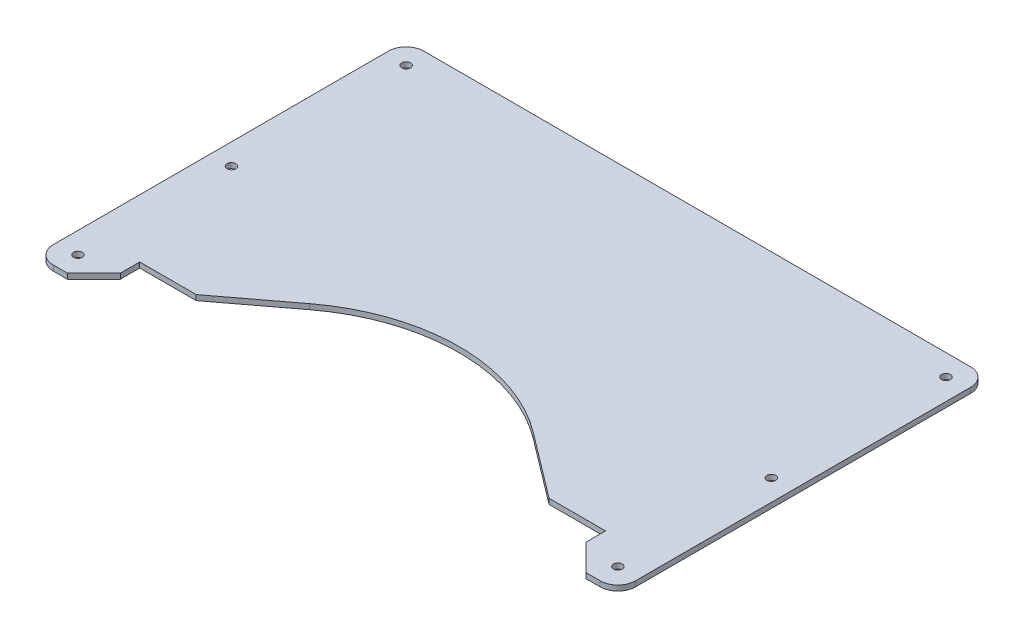
ISO-10303-21;
HEADER;
FILE_DESCRIPTION(('STEP AP214'),'2;1');
FILE_NAME('part.step','',(''),(''),'','','');
FILE_SCHEMA(('AUTOMOTIVE_DESIGN { 1 0 10303 214 1 1 1 1 }'));
ENDSEC;
DATA;
#1=APPLICATION_CONTEXT('core data for automotive mechanical design processes');
#2=APPLICATION_PROTOCOL_DEFINITION('international standard','automotive_design',2000,#1);
#3=PRODUCT_CONTEXT('',#1,'mechanical');
#4=PRODUCT('Part','Part','',(#3));
#5=PRODUCT_RELATED_PRODUCT_CATEGORY('part','',(#4));
#6=PRODUCT_DEFINITION_FORMATION('','',#4);
#7=PRODUCT_DEFINITION_CONTEXT('part definition',#1,'design');
#8=PRODUCT_DEFINITION('design','',#6,#7);
#9=PRODUCT_DEFINITION_SHAPE('','',#8);
#10=(LENGTH_UNIT() NAMED_UNIT(*) SI_UNIT(.MILLI.,.METRE.));
#11=(NAMED_UNIT(*) PLANE_ANGLE_UNIT() SI_UNIT($,.RADIAN.));
#12=(NAMED_UNIT(*) SI_UNIT($,.STERADIAN.) SOLID_ANGLE_UNIT());
#13=UNCERTAINTY_MEASURE_WITH_UNIT(LENGTH_MEASURE(1.E-05),#10,'distance_accuracy_value','');
#14=(GEOMETRIC_REPRESENTATION_CONTEXT(3) GLOBAL_UNCERTAINTY_ASSIGNED_CONTEXT((#13)) GLOBAL_UNIT_ASSIGNED_CONTEXT((#10,
#11,#12)) REPRESENTATION_CONTEXT('',''));
#15=CARTESIAN_POINT('',(0.,0.,0.));
#16=DIRECTION('',(0.,0.,1.));
#17=DIRECTION('',(1.,0.,0.));
#18=AXIS2_PLACEMENT_3D('',#15,#16,#17);
#19=CARTESIAN_POINT('',(0.,3.,240.));
#20=DIRECTION('',(0.,-1.,0.));
#21=DIRECTION('',(0.,0.,-1.));
#22=AXIS2_PLACEMENT_3D('',#19,#20,#21);
#23=PLANE('',#22);
#24=CARTESIAN_POINT('',(-153.,3.,111.));
#25=DIRECTION('',(0.,1.,0.));
#26=DIRECTION('',(0.,0.,1.));
#27=AXIS2_PLACEMENT_3D('',#24,#25,#26);
#28=CIRCLE('',#27,2.5);
#29=CARTESIAN_POINT('',(-153.,3.,113.5));
#30=VERTEX_POINT('',#29);
#31=EDGE_CURVE('E346',#30,#30,#28,.T.);
#32=ORIENTED_EDGE('',*,*,#31,.F.);
#33=EDGE_LOOP('',(#32));
#34=FACE_BOUND('',#33,.T.);
#35=CARTESIAN_POINT('',(-153.,3.,198.));
#36=DIRECTION('',(0.,1.,0.));
#37=DIRECTION('',(0.,0.,1.));
#38=AXIS2_PLACEMENT_3D('',#35,#36,#37);
#39=CIRCLE('',#38,2.5);
#40=CARTESIAN_POINT('',(-153.,3.,200.5));
#41=VERTEX_POINT('',#40);
#42=EDGE_CURVE('E334',#41,#41,#39,.T.);
#43=ORIENTED_EDGE('',*,*,#42,.F.);
#44=EDGE_LOOP('',(#43));
#45=FACE_BOUND('',#44,.T.);
#46=CARTESIAN_POINT('',(-153.,3.,12.));
#47=DIRECTION('',(0.,1.,0.));
#48=DIRECTION('',(0.,0.,1.));
#49=AXIS2_PLACEMENT_3D('',#46,#47,#48);
#50=CIRCLE('',#49,2.5);
#51=CARTESIAN_POINT('',(-153.,3.,14.5));
#52=VERTEX_POINT('',#51);
#53=EDGE_CURVE('E212',#52,#52,#50,.T.);
#54=ORIENTED_EDGE('',*,*,#53,.F.);
#55=EDGE_LOOP('',(#54));
#56=FACE_BOUND('',#55,.T.);
#57=DIRECTION('',(0.,0.,1.));
#58=VECTOR('',#57,1.);
#59=CARTESIAN_POINT('',(-165.,3.,0.));
#60=LINE('',#59,#58);
#61=CARTESIAN_POINT('',(-165.,3.,10.));
#62=VERTEX_POINT('',#61);
#63=CARTESIAN_POINT('',(-165.,3.,200.));
#64=VERTEX_POINT('',#63);
#65=EDGE_CURVE('E167',#62,#64,#60,.T.);
#66=ORIENTED_EDGE('',*,*,#65,.T.);
#67=CARTESIAN_POINT('',(-155.,3.,200.));
#68=DIRECTION('',(0.,-1.,0.));
#69=DIRECTION('',(0.,0.,-1.));
#70=AXIS2_PLACEMENT_3D('',#67,#68,#69);
#71=CIRCLE('',#70,10.);
#72=CARTESIAN_POINT('',(-155.,3.,210.));
#73=VERTEX_POINT('',#72);
#74=EDGE_CURVE('E163',#64,#73,#71,.F.);
#75=ORIENTED_EDGE('',*,*,#74,.T.);
#76=DIRECTION('',(1.,0.,0.));
#77=VECTOR('',#76,1.);
#78=CARTESIAN_POINT('',(-165.,3.,210.));
#79=LINE('',#78,#77);
#80=CARTESIAN_POINT('',(-147.,3.,210.));
#81=VERTEX_POINT('',#80);
#82=EDGE_CURVE('E155',#73,#81,#79,.T.);
#83=ORIENTED_EDGE('',*,*,#82,.T.);
#84=DIRECTION('',(0.707106781186546,0.,-0.707106781186549));
#85=VECTOR('',#84,1.);
#86=CARTESIAN_POINT('',(-147.,3.,210.));
#87=LINE('',#86,#85);
#88=CARTESIAN_POINT('',(-132.,3.,195.));
#89=VERTEX_POINT('',#88);
#90=EDGE_CURVE('E160',#81,#89,#87,.T.);
#91=ORIENTED_EDGE('',*,*,#90,.T.);
#92=DIRECTION('',(0.,0.,-1.));
#93=VECTOR('',#92,1.);
#94=CARTESIAN_POINT('',(-132.,3.,184.));
#95=LINE('',#94,#93);
#96=CARTESIAN_POINT('',(-132.,3.,184.));
#97=VERTEX_POINT('',#96);
#98=EDGE_CURVE('E182',#89,#97,#95,.T.);
#99=ORIENTED_EDGE('',*,*,#98,.T.);
#100=DIRECTION('',(1.,0.,0.));
#101=VECTOR('',#100,1.);
#102=CARTESIAN_POINT('',(-132.,3.,184.));
#103=LINE('',#102,#101);
#104=CARTESIAN_POINT('',(-99.9999999999999,3.,184.));
#105=VERTEX_POINT('',#104);
#106=EDGE_CURVE('E184',#97,#105,#103,.T.);
#107=ORIENTED_EDGE('',*,*,#106,.T.);
#108=DIRECTION('',(0.797393575141904,0.,-0.603459597920534));
#109=VECTOR('',#108,1.);
#110=CARTESIAN_POINT('',(-63.363257781656,3.,156.2736746101));
#111=LINE('',#110,#109);
#112=CARTESIAN_POINT('',(-63.363257781656,3.,156.2736746101));
#113=VERTEX_POINT('',#112);
#114=EDGE_CURVE('E189',#105,#113,#111,.T.);
#115=ORIENTED_EDGE('',*,*,#114,.T.);
#116=CARTESIAN_POINT('',(0.,3.,240.));
#117=DIRECTION('',(0.,-1.,0.));
#118=DIRECTION('',(0.,0.,-1.));
#119=AXIS2_PLACEMENT_3D('',#116,#117,#118);
#120=CIRCLE('',#119,105.);
#121=CARTESIAN_POINT('',(63.363257781656,3.,156.2736746101));
#122=VERTEX_POINT('',#121);
#123=EDGE_CURVE('E191',#113,#122,#120,.T.);
#124=ORIENTED_EDGE('',*,*,#123,.T.);
#125=DIRECTION('',(0.797393575141905,0.,0.603459597920533));
#126=VECTOR('',#125,1.);
#127=CARTESIAN_POINT('',(63.363257781656,3.,156.2736746101));
#128=LINE('',#127,#126);
#129=CARTESIAN_POINT('',(100.,3.,184.));
#130=VERTEX_POINT('',#129);
#131=EDGE_CURVE('E193',#122,#130,#128,.T.);
#132=ORIENTED_EDGE('',*,*,#131,.T.);
#133=DIRECTION('',(1.,0.,0.));
#134=VECTOR('',#133,1.);
#135=CARTESIAN_POINT('',(132.,3.,184.));
#136=LINE('',#135,#134);
#137=CARTESIAN_POINT('',(132.,3.,184.));
#138=VERTEX_POINT('',#137);
#139=EDGE_CURVE('E195',#130,#138,#136,.T.);
#140=ORIENTED_EDGE('',*,*,#139,.T.);
#141=DIRECTION('',(0.,0.,1.));
#142=VECTOR('',#141,1.);
#143=CARTESIAN_POINT('',(132.,3.,184.));
#144=LINE('',#143,#142);
#145=CARTESIAN_POINT('',(132.,3.,195.));
#146=VERTEX_POINT('',#145);
#147=EDGE_CURVE('E197',#138,#146,#144,.T.);
#148=ORIENTED_EDGE('',*,*,#147,.T.);
#149=DIRECTION('',(0.707106781186547,0.,0.707106781186548));
#150=VECTOR('',#149,1.);
#151=CARTESIAN_POINT('',(147.,3.,210.));
#152=LINE('',#151,#150);
#153=CARTESIAN_POINT('',(147.,3.,210.));
#154=VERTEX_POINT('',#153);
#155=EDGE_CURVE('E199',#146,#154,#152,.T.);
#156=ORIENTED_EDGE('',*,*,#155,.T.);
#157=DIRECTION('',(1.,0.,0.));
#158=VECTOR('',#157,1.);
#159=CARTESIAN_POINT('',(165.,3.,210.));
#160=LINE('',#159,#158);
#161=CARTESIAN_POINT('',(155.,3.,210.));
#162=VERTEX_POINT('',#161);
#163=EDGE_CURVE('E201',#154,#162,#160,.T.);
#164=ORIENTED_EDGE('',*,*,#163,.T.);
#165=CARTESIAN_POINT('',(155.,3.,200.));
#166=DIRECTION('',(0.,-1.,0.));
#167=DIRECTION('',(0.,0.,-1.));
#168=AXIS2_PLACEMENT_3D('',#165,#166,#167);
#169=CIRCLE('',#168,10.);
#170=CARTESIAN_POINT('',(165.,3.,200.));
#171=VERTEX_POINT('',#170);
#172=EDGE_CURVE('E281',#162,#171,#169,.F.);
#173=ORIENTED_EDGE('',*,*,#172,.T.);
#174=DIRECTION('',(0.,0.,-1.));
#175=VECTOR('',#174,1.);
#176=CARTESIAN_POINT('',(165.,3.,0.));
#177=LINE('',#176,#175);
#178=CARTESIAN_POINT('',(165.,3.,10.));
#179=VERTEX_POINT('',#178);
#180=EDGE_CURVE('E204',#171,#179,#177,.T.);
#181=ORIENTED_EDGE('',*,*,#180,.T.);
#182=CARTESIAN_POINT('',(155.,3.,10.));
#183=DIRECTION('',(0.,-1.,0.));
#184=DIRECTION('',(0.,0.,-1.));
#185=AXIS2_PLACEMENT_3D('',#182,#183,#184);
#186=CIRCLE('',#185,10.);
#187=CARTESIAN_POINT('',(155.,3.,0.));
#188=VERTEX_POINT('',#187);
#189=EDGE_CURVE('E52',#179,#188,#186,.F.);
#190=ORIENTED_EDGE('',*,*,#189,.T.);
#191=DIRECTION('',(-1.,0.,0.));
#192=VECTOR('',#191,1.);
#193=CARTESIAN_POINT('',(165.,3.,0.));
#194=LINE('',#193,#192);
#195=CARTESIAN_POINT('',(-155.,3.,0.));
#196=VERTEX_POINT('',#195);
#197=EDGE_CURVE('E206',#188,#196,#194,.T.);
#198=ORIENTED_EDGE('',*,*,#197,.T.);
#199=CARTESIAN_POINT('',(-155.,3.,10.));
#200=DIRECTION('',(0.,-1.,0.));
#201=DIRECTION('',(0.,0.,-1.));
#202=AXIS2_PLACEMENT_3D('',#199,#200,#201);
#203=CIRCLE('',#202,10.);
#204=EDGE_CURVE('E278',#196,#62,#203,.F.);
#205=ORIENTED_EDGE('',*,*,#204,.T.);
#206=EDGE_LOOP('',(#66,#75,#83,#91,#99,#107,#115,#124,#132,#140,#148,#156,#164,#173,#181,#190,
#198,#205));
#207=FACE_BOUND('',#206,.T.);
#208=CARTESIAN_POINT('',(153.,3.,12.));
#209=DIRECTION('',(0.,1.,0.));
#210=DIRECTION('',(0.,0.,-1.));
#211=AXIS2_PLACEMENT_3D('',#208,#209,#210);
#212=CIRCLE('',#211,2.5);
#213=CARTESIAN_POINT('',(153.,3.,9.50000000000001));
#214=VERTEX_POINT('',#213);
#215=EDGE_CURVE('E328',#214,#214,#212,.T.);
#216=ORIENTED_EDGE('',*,*,#215,.F.);
#217=EDGE_LOOP('',(#216));
#218=FACE_BOUND('',#217,.T.);
#219=CARTESIAN_POINT('',(153.,3.,198.));
#220=DIRECTION('',(0.,1.,0.));
#221=DIRECTION('',(0.,0.,-1.));
#222=AXIS2_PLACEMENT_3D('',#219,#220,#221);
#223=CIRCLE('',#222,2.5);
#224=CARTESIAN_POINT('',(153.,3.,195.5));
#225=VERTEX_POINT('',#224);
#226=EDGE_CURVE('E340',#225,#225,#223,.T.);
#227=ORIENTED_EDGE('',*,*,#226,.F.);
#228=EDGE_LOOP('',(#227));
#229=FACE_BOUND('',#228,.T.);
#230=CARTESIAN_POINT('',(153.,3.,111.));
#231=DIRECTION('',(0.,1.,0.));
#232=DIRECTION('',(0.,0.,-1.));
#233=AXIS2_PLACEMENT_3D('',#230,#231,#232);
#234=CIRCLE('',#233,2.5);
#235=CARTESIAN_POINT('',(153.,3.,108.5));
#236=VERTEX_POINT('',#235);
#237=EDGE_CURVE('E352',#236,#236,#234,.T.);
#238=ORIENTED_EDGE('',*,*,#237,.F.);
#239=EDGE_LOOP('',(#238));
#240=FACE_BOUND('',#239,.T.);
#241=ADVANCED_FACE('F31',(#34,#45,#56,#207,#218,#229,#240),#23,.F.);
#242=CARTESIAN_POINT('',(0.,0.,240.));
#243=DIRECTION('',(0.,-1.,0.));
#244=DIRECTION('',(0.,0.,-1.));
#245=AXIS2_PLACEMENT_3D('',#242,#243,#244);
#246=PLANE('',#245);
#247=CARTESIAN_POINT('',(-153.,0.,111.));
#248=DIRECTION('',(0.,1.,0.));
#249=DIRECTION('',(0.,0.,1.));
#250=AXIS2_PLACEMENT_3D('',#247,#248,#249);
#251=CIRCLE('',#250,2.5);
#252=CARTESIAN_POINT('',(-153.,0.,113.5));
#253=VERTEX_POINT('',#252);
#254=EDGE_CURVE('E349',#253,#253,#251,.T.);
#255=ORIENTED_EDGE('',*,*,#254,.T.);
#256=EDGE_LOOP('',(#255));
#257=FACE_BOUND('',#256,.T.);
#258=CARTESIAN_POINT('',(-153.,0.,198.));
#259=DIRECTION('',(0.,1.,0.));
#260=DIRECTION('',(0.,0.,1.));
#261=AXIS2_PLACEMENT_3D('',#258,#259,#260);
#262=CIRCLE('',#261,2.5);
#263=CARTESIAN_POINT('',(-153.,0.,200.5));
#264=VERTEX_POINT('',#263);
#265=EDGE_CURVE('E337',#264,#264,#262,.T.);
#266=ORIENTED_EDGE('',*,*,#265,.T.);
#267=EDGE_LOOP('',(#266));
#268=FACE_BOUND('',#267,.T.);
#269=CARTESIAN_POINT('',(-153.,0.,12.));
#270=DIRECTION('',(0.,1.,0.));
#271=DIRECTION('',(0.,0.,1.));
#272=AXIS2_PLACEMENT_3D('',#269,#270,#271);
#273=CIRCLE('',#272,2.5);
#274=CARTESIAN_POINT('',(-153.,0.,14.5));
#275=VERTEX_POINT('',#274);
#276=EDGE_CURVE('E325',#275,#275,#273,.T.);
#277=ORIENTED_EDGE('',*,*,#276,.T.);
#278=EDGE_LOOP('',(#277));
#279=FACE_BOUND('',#278,.T.);
#280=DIRECTION('',(1.,0.,0.));
#281=VECTOR('',#280,1.);
#282=CARTESIAN_POINT('',(-165.,0.,210.));
#283=LINE('',#282,#281);
#284=CARTESIAN_POINT('',(-155.,0.,210.));
#285=VERTEX_POINT('',#284);
#286=CARTESIAN_POINT('',(-147.,0.,210.));
#287=VERTEX_POINT('',#286);
#288=EDGE_CURVE('E173',#285,#287,#283,.T.);
#289=ORIENTED_EDGE('',*,*,#288,.F.);
#290=CARTESIAN_POINT('',(-155.,0.,200.));
#291=DIRECTION('',(0.,-1.,0.));
#292=DIRECTION('',(0.,0.,-1.));
#293=AXIS2_PLACEMENT_3D('',#290,#291,#292);
#294=CIRCLE('',#293,10.);
#295=CARTESIAN_POINT('',(-165.,0.,200.));
#296=VERTEX_POINT('',#295);
#297=EDGE_CURVE('E271',#285,#296,#294,.T.);
#298=ORIENTED_EDGE('',*,*,#297,.T.);
#299=DIRECTION('',(0.,0.,1.));
#300=VECTOR('',#299,1.);
#301=CARTESIAN_POINT('',(-165.,0.,0.));
#302=LINE('',#301,#300);
#303=CARTESIAN_POINT('',(-165.,0.,10.));
#304=VERTEX_POINT('',#303);
#305=EDGE_CURVE('E209',#304,#296,#302,.T.);
#306=ORIENTED_EDGE('',*,*,#305,.F.);
#307=CARTESIAN_POINT('',(-155.,0.,10.));
#308=DIRECTION('',(0.,-1.,0.));
#309=DIRECTION('',(0.,0.,-1.));
#310=AXIS2_PLACEMENT_3D('',#307,#308,#309);
#311=CIRCLE('',#310,10.);
#312=CARTESIAN_POINT('',(-155.,0.,0.));
#313=VERTEX_POINT('',#312);
#314=EDGE_CURVE('E265',#304,#313,#311,.T.);
#315=ORIENTED_EDGE('',*,*,#314,.T.);
#316=DIRECTION('',(-1.,0.,0.));
#317=VECTOR('',#316,1.);
#318=CARTESIAN_POINT('',(165.,0.,0.));
#319=LINE('',#318,#317);
#320=CARTESIAN_POINT('',(155.,0.,0.));
#321=VERTEX_POINT('',#320);
#322=EDGE_CURVE('E238',#321,#313,#319,.T.);
#323=ORIENTED_EDGE('',*,*,#322,.F.);
#324=CARTESIAN_POINT('',(155.,0.,10.));
#325=DIRECTION('',(0.,-1.,0.));
#326=DIRECTION('',(0.,0.,-1.));
#327=AXIS2_PLACEMENT_3D('',#324,#325,#326);
#328=CIRCLE('',#327,10.);
#329=CARTESIAN_POINT('',(165.,0.,10.));
#330=VERTEX_POINT('',#329);
#331=EDGE_CURVE('E267',#321,#330,#328,.T.);
#332=ORIENTED_EDGE('',*,*,#331,.T.);
#333=DIRECTION('',(0.,0.,-1.));
#334=VECTOR('',#333,1.);
#335=CARTESIAN_POINT('',(165.,0.,0.));
#336=LINE('',#335,#334);
#337=CARTESIAN_POINT('',(165.,0.,200.));
#338=VERTEX_POINT('',#337);
#339=EDGE_CURVE('E235',#338,#330,#336,.T.);
#340=ORIENTED_EDGE('',*,*,#339,.F.);
#341=CARTESIAN_POINT('',(155.,0.,200.));
#342=DIRECTION('',(0.,-1.,0.));
#343=DIRECTION('',(0.,0.,-1.));
#344=AXIS2_PLACEMENT_3D('',#341,#342,#343);
#345=CIRCLE('',#344,10.);
#346=CARTESIAN_POINT('',(155.,0.,210.));
#347=VERTEX_POINT('',#346);
#348=EDGE_CURVE('E269',#338,#347,#345,.T.);
#349=ORIENTED_EDGE('',*,*,#348,.T.);
#350=DIRECTION('',(1.,0.,0.));
#351=VECTOR('',#350,1.);
#352=CARTESIAN_POINT('',(165.,0.,210.));
#353=LINE('',#352,#351);
#354=CARTESIAN_POINT('',(147.,0.,210.));
#355=VERTEX_POINT('',#354);
#356=EDGE_CURVE('E232',#355,#347,#353,.T.);
#357=ORIENTED_EDGE('',*,*,#356,.F.);
#358=DIRECTION('',(0.707106781186547,0.,0.707106781186548));
#359=VECTOR('',#358,1.);
#360=CARTESIAN_POINT('',(147.,0.,210.));
#361=LINE('',#360,#359);
#362=CARTESIAN_POINT('',(132.,0.,195.));
#363=VERTEX_POINT('',#362);
#364=EDGE_CURVE('E230',#363,#355,#361,.T.);
#365=ORIENTED_EDGE('',*,*,#364,.F.);
#366=DIRECTION('',(0.,0.,1.));
#367=VECTOR('',#366,1.);
#368=CARTESIAN_POINT('',(132.,0.,184.));
#369=LINE('',#368,#367);
#370=CARTESIAN_POINT('',(132.,0.,184.));
#371=VERTEX_POINT('',#370);
#372=EDGE_CURVE('E228',#371,#363,#369,.T.);
#373=ORIENTED_EDGE('',*,*,#372,.F.);
#374=DIRECTION('',(1.,0.,0.));
#375=VECTOR('',#374,1.);
#376=CARTESIAN_POINT('',(132.,0.,184.));
#377=LINE('',#376,#375);
#378=CARTESIAN_POINT('',(100.,0.,184.));
#379=VERTEX_POINT('',#378);
#380=EDGE_CURVE('E226',#379,#371,#377,.T.);
#381=ORIENTED_EDGE('',*,*,#380,.F.);
#382=DIRECTION('',(0.797393575141905,0.,0.603459597920533));
#383=VECTOR('',#382,1.);
#384=CARTESIAN_POINT('',(63.363257781656,0.,156.2736746101));
#385=LINE('',#384,#383);
#386=CARTESIAN_POINT('',(63.363257781656,0.,156.2736746101));
#387=VERTEX_POINT('',#386);
#388=EDGE_CURVE('E224',#387,#379,#385,.T.);
#389=ORIENTED_EDGE('',*,*,#388,.F.);
#390=CARTESIAN_POINT('',(0.,0.,240.));
#391=DIRECTION('',(0.,-1.,0.));
#392=DIRECTION('',(0.,0.,-1.));
#393=AXIS2_PLACEMENT_3D('',#390,#391,#392);
#394=CIRCLE('',#393,105.);
#395=CARTESIAN_POINT('',(-63.363257781656,0.,156.2736746101));
#396=VERTEX_POINT('',#395);
#397=EDGE_CURVE('E222',#396,#387,#394,.T.);
#398=ORIENTED_EDGE('',*,*,#397,.F.);
#399=DIRECTION('',(0.797393575141904,0.,-0.603459597920534));
#400=VECTOR('',#399,1.);
#401=CARTESIAN_POINT('',(-63.363257781656,0.,156.2736746101));
#402=LINE('',#401,#400);
#403=CARTESIAN_POINT('',(-99.9999999999999,0.,184.));
#404=VERTEX_POINT('',#403);
#405=EDGE_CURVE('E220',#404,#396,#402,.T.);
#406=ORIENTED_EDGE('',*,*,#405,.F.);
#407=DIRECTION('',(1.,0.,0.));
#408=VECTOR('',#407,1.);
#409=CARTESIAN_POINT('',(-132.,0.,184.));
#410=LINE('',#409,#408);
#411=CARTESIAN_POINT('',(-132.,0.,184.));
#412=VERTEX_POINT('',#411);
#413=EDGE_CURVE('E218',#412,#404,#410,.T.);
#414=ORIENTED_EDGE('',*,*,#413,.F.);
#415=DIRECTION('',(0.,0.,-1.));
#416=VECTOR('',#415,1.);
#417=CARTESIAN_POINT('',(-132.,0.,184.));
#418=LINE('',#417,#416);
#419=CARTESIAN_POINT('',(-132.,0.,195.));
#420=VERTEX_POINT('',#419);
#421=EDGE_CURVE('E216',#420,#412,#418,.T.);
#422=ORIENTED_EDGE('',*,*,#421,.F.);
#423=DIRECTION('',(0.707106781186546,0.,-0.707106781186549));
#424=VECTOR('',#423,1.);
#425=CARTESIAN_POINT('',(-147.,0.,210.));
#426=LINE('',#425,#424);
#427=EDGE_CURVE('E214',#287,#420,#426,.T.);
#428=ORIENTED_EDGE('',*,*,#427,.F.);
#429=EDGE_LOOP('',(#289,#298,#306,#315,#323,#332,#340,#349,#357,#365,#373,#381,#389,#398,#406,
#414,#422,#428));
#430=FACE_BOUND('',#429,.T.);
#431=CARTESIAN_POINT('',(153.,0.,12.));
#432=DIRECTION('',(0.,1.,0.));
#433=DIRECTION('',(0.,0.,-1.));
#434=AXIS2_PLACEMENT_3D('',#431,#432,#433);
#435=CIRCLE('',#434,2.5);
#436=CARTESIAN_POINT('',(153.,0.,9.50000000000001));
#437=VERTEX_POINT('',#436);
#438=EDGE_CURVE('E331',#437,#437,#435,.T.);
#439=ORIENTED_EDGE('',*,*,#438,.T.);
#440=EDGE_LOOP('',(#439));
#441=FACE_BOUND('',#440,.T.);
#442=CARTESIAN_POINT('',(153.,0.,198.));
#443=DIRECTION('',(0.,1.,0.));
#444=DIRECTION('',(0.,0.,-1.));
#445=AXIS2_PLACEMENT_3D('',#442,#443,#444);
#446=CIRCLE('',#445,2.5);
#447=CARTESIAN_POINT('',(153.,0.,195.5));
#448=VERTEX_POINT('',#447);
#449=EDGE_CURVE('E343',#448,#448,#446,.T.);
#450=ORIENTED_EDGE('',*,*,#449,.T.);
#451=EDGE_LOOP('',(#450));
#452=FACE_BOUND('',#451,.T.);
#453=CARTESIAN_POINT('',(153.,0.,111.));
#454=DIRECTION('',(0.,1.,0.));
#455=DIRECTION('',(0.,0.,-1.));
#456=AXIS2_PLACEMENT_3D('',#453,#454,#455);
#457=CIRCLE('',#456,2.5);
#458=CARTESIAN_POINT('',(153.,0.,108.5));
#459=VERTEX_POINT('',#458);
#460=EDGE_CURVE('E355',#459,#459,#457,.T.);
#461=ORIENTED_EDGE('',*,*,#460,.T.);
#462=EDGE_LOOP('',(#461));
#463=FACE_BOUND('',#462,.T.);
#464=ADVANCED_FACE('F307',(#257,#268,#279,#430,#441,#452,#463),#246,.T.);
#465=CARTESIAN_POINT('',(-165.,3.,0.));
#466=DIRECTION('',(1.,0.,0.));
#467=DIRECTION('',(0.,0.,-1.));
#468=AXIS2_PLACEMENT_3D('',#465,#466,#467);
#469=PLANE('',#468);
#470=ORIENTED_EDGE('',*,*,#305,.T.);
#471=DIRECTION('',(0.,-1.,0.));
#472=VECTOR('',#471,1.);
#473=CARTESIAN_POINT('',(-165.,3.,200.));
#474=LINE('',#473,#472);
#475=EDGE_CURVE('E276',#296,#64,#474,.F.);
#476=ORIENTED_EDGE('',*,*,#475,.T.);
#477=ORIENTED_EDGE('',*,*,#65,.F.);
#478=DIRECTION('',(0.,-1.,0.));
#479=VECTOR('',#478,1.);
#480=CARTESIAN_POINT('',(-165.,3.,10.));
#481=LINE('',#480,#479);
#482=EDGE_CURVE('E273',#62,#304,#481,.T.);
#483=ORIENTED_EDGE('',*,*,#482,.T.);
#484=EDGE_LOOP('',(#470,#476,#477,#483));
#485=FACE_BOUND('',#484,.T.);
#486=ADVANCED_FACE('F320',(#485),#469,.F.);
#487=CARTESIAN_POINT('',(-165.,3.,210.));
#488=DIRECTION('',(0.,0.,-1.));
#489=DIRECTION('',(-1.,0.,0.));
#490=AXIS2_PLACEMENT_3D('',#487,#488,#489);
#491=PLANE('',#490);
#492=ORIENTED_EDGE('',*,*,#82,.F.);
#493=DIRECTION('',(0.,-1.,0.));
#494=VECTOR('',#493,1.);
#495=CARTESIAN_POINT('',(-155.,3.,210.));
#496=LINE('',#495,#494);
#497=EDGE_CURVE('E176',#73,#285,#496,.T.);
#498=ORIENTED_EDGE('',*,*,#497,.T.);
#499=ORIENTED_EDGE('',*,*,#288,.T.);
#500=DIRECTION('',(0.,-1.,0.));
#501=VECTOR('',#500,1.);
#502=CARTESIAN_POINT('',(-147.,3.,210.));
#503=LINE('',#502,#501);
#504=EDGE_CURVE('E170',#81,#287,#503,.T.);
#505=ORIENTED_EDGE('',*,*,#504,.F.);
#506=EDGE_LOOP('',(#492,#498,#499,#505));
#507=FACE_BOUND('',#506,.T.);
#508=ADVANCED_FACE('F171',(#507),#491,.F.);
#509=CARTESIAN_POINT('',(-147.,3.,210.));
#510=DIRECTION('',(-0.707106781186549,0.,-0.707106781186546));
#511=DIRECTION('',(-0.707106781186546,0.,0.707106781186549));
#512=AXIS2_PLACEMENT_3D('',#509,#510,#511);
#513=PLANE('',#512);
#514=ORIENTED_EDGE('',*,*,#427,.T.);
#515=DIRECTION('',(0.,-1.,0.));
#516=VECTOR('',#515,1.);
#517=CARTESIAN_POINT('',(-132.,3.,195.));
#518=LINE('',#517,#516);
#519=EDGE_CURVE('E177',#89,#420,#518,.T.);
#520=ORIENTED_EDGE('',*,*,#519,.F.);
#521=ORIENTED_EDGE('',*,*,#90,.F.);
#522=ORIENTED_EDGE('',*,*,#504,.T.);
#523=EDGE_LOOP('',(#514,#520,#521,#522));
#524=FACE_BOUND('',#523,.T.);
#525=ADVANCED_FACE('F179',(#524),#513,.F.);
#526=CARTESIAN_POINT('',(-132.,3.,184.));
#527=DIRECTION('',(-1.,0.,0.));
#528=DIRECTION('',(0.,0.,1.));
#529=AXIS2_PLACEMENT_3D('',#526,#527,#528);
#530=PLANE('',#529);
#531=ORIENTED_EDGE('',*,*,#421,.T.);
#532=DIRECTION('',(0.,-1.,0.));
#533=VECTOR('',#532,1.);
#534=CARTESIAN_POINT('',(-132.,3.,184.));
#535=LINE('',#534,#533);
#536=EDGE_CURVE('E260',#97,#412,#535,.T.);
#537=ORIENTED_EDGE('',*,*,#536,.F.);
#538=ORIENTED_EDGE('',*,*,#98,.F.);
#539=ORIENTED_EDGE('',*,*,#519,.T.);
#540=EDGE_LOOP('',(#531,#537,#538,#539));
#541=FACE_BOUND('',#540,.T.);
#542=ADVANCED_FACE('F411',(#541),#530,.F.);
#543=CARTESIAN_POINT('',(-132.,3.,184.));
#544=DIRECTION('',(0.,0.,-1.));
#545=DIRECTION('',(-1.,0.,0.));
#546=AXIS2_PLACEMENT_3D('',#543,#544,#545);
#547=PLANE('',#546);
#548=ORIENTED_EDGE('',*,*,#413,.T.);
#549=DIRECTION('',(0.,-1.,0.));
#550=VECTOR('',#549,1.);
#551=CARTESIAN_POINT('',(-99.9999999999999,3.,184.));
#552=LINE('',#551,#550);
#553=EDGE_CURVE('E257',#105,#404,#552,.T.);
#554=ORIENTED_EDGE('',*,*,#553,.F.);
#555=ORIENTED_EDGE('',*,*,#106,.F.);
#556=ORIENTED_EDGE('',*,*,#536,.T.);
#557=EDGE_LOOP('',(#548,#554,#555,#556));
#558=FACE_BOUND('',#557,.T.);
#559=ADVANCED_FACE('F407',(#558),#547,.F.);
#560=CARTESIAN_POINT('',(-63.363257781656,3.,156.2736746101));
#561=DIRECTION('',(-0.603459597920534,0.,-0.797393575141904));
#562=DIRECTION('',(-0.797393575141904,0.,0.603459597920534));
#563=AXIS2_PLACEMENT_3D('',#560,#561,#562);
#564=PLANE('',#563);
#565=ORIENTED_EDGE('',*,*,#405,.T.);
#566=DIRECTION('',(0.,-1.,0.));
#567=VECTOR('',#566,1.);
#568=CARTESIAN_POINT('',(-63.363257781656,3.,156.2736746101));
#569=LINE('',#568,#567);
#570=EDGE_CURVE('E254',#113,#396,#569,.T.);
#571=ORIENTED_EDGE('',*,*,#570,.F.);
#572=ORIENTED_EDGE('',*,*,#114,.F.);
#573=ORIENTED_EDGE('',*,*,#553,.T.);
#574=EDGE_LOOP('',(#565,#571,#572,#573));
#575=FACE_BOUND('',#574,.T.);
#576=ADVANCED_FACE('F403',(#575),#564,.F.);
#577=CARTESIAN_POINT('',(0.,3.,240.));
#578=DIRECTION('',(0.,-1.,0.));
#579=DIRECTION('',(0.,0.,-1.));
#580=AXIS2_PLACEMENT_3D('',#577,#578,#579);
#581=CYLINDRICAL_SURFACE('',#580,105.);
#582=ORIENTED_EDGE('',*,*,#397,.T.);
#583=DIRECTION('',(0.,-1.,0.));
#584=VECTOR('',#583,1.);
#585=CARTESIAN_POINT('',(63.363257781656,3.,156.2736746101));
#586=LINE('',#585,#584);
#587=EDGE_CURVE('E251',#122,#387,#586,.T.);
#588=ORIENTED_EDGE('',*,*,#587,.F.);
#589=ORIENTED_EDGE('',*,*,#123,.F.);
#590=ORIENTED_EDGE('',*,*,#570,.T.);
#591=EDGE_LOOP('',(#582,#588,#589,#590));
#592=FACE_BOUND('',#591,.T.);
#593=ADVANCED_FACE('F399',(#592),#581,.F.);
#594=CARTESIAN_POINT('',(63.363257781656,3.,156.2736746101));
#595=DIRECTION('',(0.603459597920533,0.,-0.797393575141905));
#596=DIRECTION('',(-0.797393575141905,0.,-0.603459597920533));
#597=AXIS2_PLACEMENT_3D('',#594,#595,#596);
#598=PLANE('',#597);
#599=ORIENTED_EDGE('',*,*,#388,.T.);
#600=DIRECTION('',(0.,-1.,0.));
#601=VECTOR('',#600,1.);
#602=CARTESIAN_POINT('',(100.,3.,184.));
#603=LINE('',#602,#601);
#604=EDGE_CURVE('E248',#130,#379,#603,.T.);
#605=ORIENTED_EDGE('',*,*,#604,.F.);
#606=ORIENTED_EDGE('',*,*,#131,.F.);
#607=ORIENTED_EDGE('',*,*,#587,.T.);
#608=EDGE_LOOP('',(#599,#605,#606,#607));
#609=FACE_BOUND('',#608,.T.);
#610=ADVANCED_FACE('F395',(#609),#598,.F.);
#611=CARTESIAN_POINT('',(132.,3.,184.));
#612=DIRECTION('',(0.,0.,-1.));
#613=DIRECTION('',(-1.,0.,0.));
#614=AXIS2_PLACEMENT_3D('',#611,#612,#613);
#615=PLANE('',#614);
#616=ORIENTED_EDGE('',*,*,#380,.T.);
#617=DIRECTION('',(0.,-1.,0.));
#618=VECTOR('',#617,1.);
#619=CARTESIAN_POINT('',(132.,3.,184.));
#620=LINE('',#619,#618);
#621=EDGE_CURVE('E245',#138,#371,#620,.T.);
#622=ORIENTED_EDGE('',*,*,#621,.F.);
#623=ORIENTED_EDGE('',*,*,#139,.F.);
#624=ORIENTED_EDGE('',*,*,#604,.T.);
#625=EDGE_LOOP('',(#616,#622,#623,#624));
#626=FACE_BOUND('',#625,.T.);
#627=ADVANCED_FACE('F391',(#626),#615,.F.);
#628=CARTESIAN_POINT('',(132.,3.,184.));
#629=DIRECTION('',(1.,0.,0.));
#630=DIRECTION('',(0.,0.,-1.));
#631=AXIS2_PLACEMENT_3D('',#628,#629,#630);
#632=PLANE('',#631);
#633=ORIENTED_EDGE('',*,*,#372,.T.);
#634=DIRECTION('',(0.,-1.,0.));
#635=VECTOR('',#634,1.);
#636=CARTESIAN_POINT('',(132.,3.,195.));
#637=LINE('',#636,#635);
#638=EDGE_CURVE('E242',#146,#363,#637,.T.);
#639=ORIENTED_EDGE('',*,*,#638,.F.);
#640=ORIENTED_EDGE('',*,*,#147,.F.);
#641=ORIENTED_EDGE('',*,*,#621,.T.);
#642=EDGE_LOOP('',(#633,#639,#640,#641));
#643=FACE_BOUND('',#642,.T.);
#644=ADVANCED_FACE('F387',(#643),#632,.F.);
#645=CARTESIAN_POINT('',(147.,3.,210.));
#646=DIRECTION('',(0.707106781186548,0.,-0.707106781186547));
#647=DIRECTION('',(-0.707106781186547,0.,-0.707106781186548));
#648=AXIS2_PLACEMENT_3D('',#645,#646,#647);
#649=PLANE('',#648);
#650=ORIENTED_EDGE('',*,*,#364,.T.);
#651=DIRECTION('',(0.,-1.,0.));
#652=VECTOR('',#651,1.);
#653=CARTESIAN_POINT('',(147.,3.,210.));
#654=LINE('',#653,#652);
#655=EDGE_CURVE('E208',#154,#355,#654,.T.);
#656=ORIENTED_EDGE('',*,*,#655,.F.);
#657=ORIENTED_EDGE('',*,*,#155,.F.);
#658=ORIENTED_EDGE('',*,*,#638,.T.);
#659=EDGE_LOOP('',(#650,#656,#657,#658));
#660=FACE_BOUND('',#659,.T.);
#661=ADVANCED_FACE('F384',(#660),#649,.F.);
#662=CARTESIAN_POINT('',(165.,3.,210.));
#663=DIRECTION('',(0.,0.,-1.));
#664=DIRECTION('',(-1.,0.,0.));
#665=AXIS2_PLACEMENT_3D('',#662,#663,#664);
#666=PLANE('',#665);
#667=ORIENTED_EDGE('',*,*,#356,.T.);
#668=DIRECTION('',(0.,-1.,0.));
#669=VECTOR('',#668,1.);
#670=CARTESIAN_POINT('',(155.,3.,210.));
#671=LINE('',#670,#669);
#672=EDGE_CURVE('E289',#347,#162,#671,.F.);
#673=ORIENTED_EDGE('',*,*,#672,.T.);
#674=ORIENTED_EDGE('',*,*,#163,.F.);
#675=ORIENTED_EDGE('',*,*,#655,.T.);
#676=EDGE_LOOP('',(#667,#673,#674,#675));
#677=FACE_BOUND('',#676,.T.);
#678=ADVANCED_FACE('F293',(#677),#666,.F.);
#679=CARTESIAN_POINT('',(165.,3.,0.));
#680=DIRECTION('',(-1.,0.,0.));
#681=DIRECTION('',(0.,0.,1.));
#682=AXIS2_PLACEMENT_3D('',#679,#680,#681);
#683=PLANE('',#682);
#684=ORIENTED_EDGE('',*,*,#180,.F.);
#685=DIRECTION('',(0.,-1.,0.));
#686=VECTOR('',#685,1.);
#687=CARTESIAN_POINT('',(165.,3.,200.));
#688=LINE('',#687,#686);
#689=EDGE_CURVE('E286',#171,#338,#688,.T.);
#690=ORIENTED_EDGE('',*,*,#689,.T.);
#691=ORIENTED_EDGE('',*,*,#339,.T.);
#692=DIRECTION('',(0.,-1.,0.));
#693=VECTOR('',#692,1.);
#694=CARTESIAN_POINT('',(165.,3.,10.));
#695=LINE('',#694,#693);
#696=EDGE_CURVE('E284',#330,#179,#695,.F.);
#697=ORIENTED_EDGE('',*,*,#696,.T.);
#698=EDGE_LOOP('',(#684,#690,#691,#697));
#699=FACE_BOUND('',#698,.T.);
#700=ADVANCED_FACE('F304',(#699),#683,.F.);
#701=CARTESIAN_POINT('',(165.,3.,0.));
#702=DIRECTION('',(0.,0.,1.));
#703=DIRECTION('',(1.,0.,0.));
#704=AXIS2_PLACEMENT_3D('',#701,#702,#703);
#705=PLANE('',#704);
#706=ORIENTED_EDGE('',*,*,#197,.F.);
#707=DIRECTION('',(0.,-1.,0.));
#708=VECTOR('',#707,1.);
#709=CARTESIAN_POINT('',(155.,3.,0.));
#710=LINE('',#709,#708);
#711=EDGE_CURVE('E11',#188,#321,#710,.T.);
#712=ORIENTED_EDGE('',*,*,#711,.T.);
#713=ORIENTED_EDGE('',*,*,#322,.T.);
#714=DIRECTION('',(0.,-1.,0.));
#715=VECTOR('',#714,1.);
#716=CARTESIAN_POINT('',(-155.,3.,0.));
#717=LINE('',#716,#715);
#718=EDGE_CURVE('E39',#313,#196,#717,.F.);
#719=ORIENTED_EDGE('',*,*,#718,.T.);
#720=EDGE_LOOP('',(#706,#712,#713,#719));
#721=FACE_BOUND('',#720,.T.);
#722=ADVANCED_FACE('F313',(#721),#705,.F.);
#723=CARTESIAN_POINT('',(-153.,3.,12.));
#724=DIRECTION('',(0.,-1.,0.));
#725=DIRECTION('',(0.,0.,-1.));
#726=AXIS2_PLACEMENT_3D('',#723,#724,#725);
#727=CYLINDRICAL_SURFACE('',#726,2.5);
#728=ORIENTED_EDGE('',*,*,#53,.T.);
#729=EDGE_LOOP('',(#728));
#730=FACE_BOUND('',#729,.T.);
#731=ORIENTED_EDGE('',*,*,#276,.F.);
#732=EDGE_LOOP('',(#731));
#733=FACE_BOUND('',#732,.T.);
#734=ADVANCED_FACE('F375',(#730,#733),#727,.F.);
#735=CARTESIAN_POINT('',(153.,3.,12.));
#736=DIRECTION('',(0.,-1.,0.));
#737=DIRECTION('',(0.,0.,-1.));
#738=AXIS2_PLACEMENT_3D('',#735,#736,#737);
#739=CYLINDRICAL_SURFACE('',#738,2.5);
#740=ORIENTED_EDGE('',*,*,#215,.T.);
#741=EDGE_LOOP('',(#740));
#742=FACE_BOUND('',#741,.T.);
#743=ORIENTED_EDGE('',*,*,#438,.F.);
#744=EDGE_LOOP('',(#743));
#745=FACE_BOUND('',#744,.T.);
#746=ADVANCED_FACE('F529',(#742,#745),#739,.F.);
#747=CARTESIAN_POINT('',(-153.,3.,198.));
#748=DIRECTION('',(0.,-1.,0.));
#749=DIRECTION('',(0.,0.,-1.));
#750=AXIS2_PLACEMENT_3D('',#747,#748,#749);
#751=CYLINDRICAL_SURFACE('',#750,2.5);
#752=ORIENTED_EDGE('',*,*,#42,.T.);
#753=EDGE_LOOP('',(#752));
#754=FACE_BOUND('',#753,.T.);
#755=ORIENTED_EDGE('',*,*,#265,.F.);
#756=EDGE_LOOP('',(#755));
#757=FACE_BOUND('',#756,.T.);
#758=ADVANCED_FACE('F519',(#754,#757),#751,.F.);
#759=CARTESIAN_POINT('',(153.,3.,198.));
#760=DIRECTION('',(0.,-1.,0.));
#761=DIRECTION('',(0.,0.,-1.));
#762=AXIS2_PLACEMENT_3D('',#759,#760,#761);
#763=CYLINDRICAL_SURFACE('',#762,2.5);
#764=ORIENTED_EDGE('',*,*,#226,.T.);
#765=EDGE_LOOP('',(#764));
#766=FACE_BOUND('',#765,.T.);
#767=ORIENTED_EDGE('',*,*,#449,.F.);
#768=EDGE_LOOP('',(#767));
#769=FACE_BOUND('',#768,.T.);
#770=ADVANCED_FACE('F509',(#766,#769),#763,.F.);
#771=CARTESIAN_POINT('',(-153.,3.,111.));
#772=DIRECTION('',(0.,-1.,0.));
#773=DIRECTION('',(0.,0.,-1.));
#774=AXIS2_PLACEMENT_3D('',#771,#772,#773);
#775=CYLINDRICAL_SURFACE('',#774,2.5);
#776=ORIENTED_EDGE('',*,*,#31,.T.);
#777=EDGE_LOOP('',(#776));
#778=FACE_BOUND('',#777,.T.);
#779=ORIENTED_EDGE('',*,*,#254,.F.);
#780=EDGE_LOOP('',(#779));
#781=FACE_BOUND('',#780,.T.);
#782=ADVANCED_FACE('F500',(#778,#781),#775,.F.);
#783=CARTESIAN_POINT('',(153.,3.,111.));
#784=DIRECTION('',(0.,-1.,0.));
#785=DIRECTION('',(0.,0.,-1.));
#786=AXIS2_PLACEMENT_3D('',#783,#784,#785);
#787=CYLINDRICAL_SURFACE('',#786,2.5);
#788=ORIENTED_EDGE('',*,*,#237,.T.);
#789=EDGE_LOOP('',(#788));
#790=FACE_BOUND('',#789,.T.);
#791=ORIENTED_EDGE('',*,*,#460,.F.);
#792=EDGE_LOOP('',(#791));
#793=FACE_BOUND('',#792,.T.);
#794=ADVANCED_FACE('F361',(#790,#793),#787,.F.);
#795=CARTESIAN_POINT('',(-155.,3.,200.));
#796=DIRECTION('',(0.,-1.,0.));
#797=DIRECTION('',(0.,0.,-1.));
#798=AXIS2_PLACEMENT_3D('',#795,#796,#797);
#799=CYLINDRICAL_SURFACE('',#798,10.);
#800=ORIENTED_EDGE('',*,*,#74,.F.);
#801=ORIENTED_EDGE('',*,*,#475,.F.);
#802=ORIENTED_EDGE('',*,*,#297,.F.);
#803=ORIENTED_EDGE('',*,*,#497,.F.);
#804=EDGE_LOOP('',(#800,#801,#802,#803));
#805=FACE_BOUND('',#804,.T.);
#806=ADVANCED_FACE('F323',(#805),#799,.T.);
#807=CARTESIAN_POINT('',(155.,3.,200.));
#808=DIRECTION('',(0.,-1.,0.));
#809=DIRECTION('',(0.,0.,-1.));
#810=AXIS2_PLACEMENT_3D('',#807,#808,#809);
#811=CYLINDRICAL_SURFACE('',#810,10.);
#812=ORIENTED_EDGE('',*,*,#172,.F.);
#813=ORIENTED_EDGE('',*,*,#672,.F.);
#814=ORIENTED_EDGE('',*,*,#348,.F.);
#815=ORIENTED_EDGE('',*,*,#689,.F.);
#816=EDGE_LOOP('',(#812,#813,#814,#815));
#817=FACE_BOUND('',#816,.T.);
#818=ADVANCED_FACE('F301',(#817),#811,.T.);
#819=CARTESIAN_POINT('',(155.,3.,10.));
#820=DIRECTION('',(0.,-1.,0.));
#821=DIRECTION('',(0.,0.,-1.));
#822=AXIS2_PLACEMENT_3D('',#819,#820,#821);
#823=CYLINDRICAL_SURFACE('',#822,10.);
#824=ORIENTED_EDGE('',*,*,#189,.F.);
#825=ORIENTED_EDGE('',*,*,#696,.F.);
#826=ORIENTED_EDGE('',*,*,#331,.F.);
#827=ORIENTED_EDGE('',*,*,#711,.F.);
#828=EDGE_LOOP('',(#824,#825,#826,#827));
#829=FACE_BOUND('',#828,.T.);
#830=ADVANCED_FACE('F312',(#829),#823,.T.);
#831=CARTESIAN_POINT('',(-155.,3.,10.));
#832=DIRECTION('',(0.,-1.,0.));
#833=DIRECTION('',(0.,0.,-1.));
#834=AXIS2_PLACEMENT_3D('',#831,#832,#833);
#835=CYLINDRICAL_SURFACE('',#834,10.);
#836=ORIENTED_EDGE('',*,*,#204,.F.);
#837=ORIENTED_EDGE('',*,*,#718,.F.);
#838=ORIENTED_EDGE('',*,*,#314,.F.);
#839=ORIENTED_EDGE('',*,*,#482,.F.);
#840=EDGE_LOOP('',(#836,#837,#838,#839));
#841=FACE_BOUND('',#840,.T.);
#842=ADVANCED_FACE('F33',(#841),#835,.T.);
#843=CLOSED_SHELL('',(#241,#464,#486,#508,#525,#542,#559,#576,#593,#610,#627,#644,#661,#678,
#700,#722,#734,#746,#758,#770,#782,#794,#806,#818,#830,#842));
#844=MANIFOLD_SOLID_BREP('B2',#843);
#845=ADVANCED_BREP_SHAPE_REPRESENTATION('',(#18,#844),#14);
#846=SHAPE_DEFINITION_REPRESENTATION(#9,#845);
ENDSEC;
END-ISO-10303-21;
